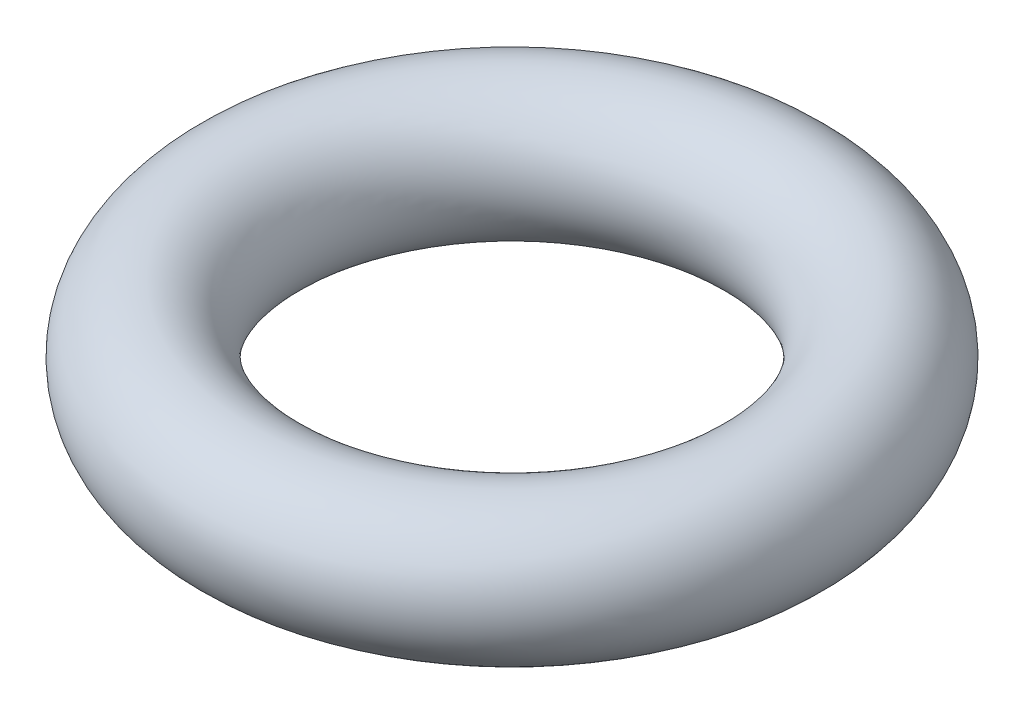
ISO-10303-21;
HEADER;
FILE_DESCRIPTION(('STEP AP214'),'2;1');
FILE_NAME('part.step','',(''),(''),'','','');
FILE_SCHEMA(('AUTOMOTIVE_DESIGN { 1 0 10303 214 1 1 1 1 }'));
ENDSEC;
DATA;
#1=APPLICATION_CONTEXT('core data for automotive mechanical design processes');
#2=APPLICATION_PROTOCOL_DEFINITION('international standard','automotive_design',2000,#1);
#3=PRODUCT_CONTEXT('',#1,'mechanical');
#4=PRODUCT('Part','Part','',(#3));
#5=PRODUCT_RELATED_PRODUCT_CATEGORY('part','',(#4));
#6=PRODUCT_DEFINITION_FORMATION('','',#4);
#7=PRODUCT_DEFINITION_CONTEXT('part definition',#1,'design');
#8=PRODUCT_DEFINITION('design','',#6,#7);
#9=PRODUCT_DEFINITION_SHAPE('','',#8);
#10=(LENGTH_UNIT() NAMED_UNIT(*) SI_UNIT(.MILLI.,.METRE.));
#11=(NAMED_UNIT(*) PLANE_ANGLE_UNIT() SI_UNIT($,.RADIAN.));
#12=(NAMED_UNIT(*) SI_UNIT($,.STERADIAN.) SOLID_ANGLE_UNIT());
#13=UNCERTAINTY_MEASURE_WITH_UNIT(LENGTH_MEASURE(1.E-05),#10,'distance_accuracy_value','');
#14=(GEOMETRIC_REPRESENTATION_CONTEXT(3) GLOBAL_UNCERTAINTY_ASSIGNED_CONTEXT((#13)) GLOBAL_UNIT_ASSIGNED_CONTEXT((#10,
#11,#12)) REPRESENTATION_CONTEXT('',''));
#15=CARTESIAN_POINT('',(0.,0.,0.));
#16=DIRECTION('',(0.,0.,1.));
#17=DIRECTION('',(1.,0.,0.));
#18=AXIS2_PLACEMENT_3D('',#15,#16,#17);
#19=CARTESIAN_POINT('',(0.,0.,0.));
#20=DIRECTION('',(0.,-1.,0.));
#21=DIRECTION('',(0.,0.,-1.));
#22=AXIS2_PLACEMENT_3D('',#19,#20,#21);
#23=TOROIDAL_SURFACE('',#22,4.75,1.25);
#24=CARTESIAN_POINT('',(0.,0.,-6.));
#25=VERTEX_POINT('',#24);
#26=VERTEX_LOOP('',#25);
#27=FACE_BOUND('',#26,.T.);
#28=ADVANCED_FACE('F28',(#27),#23,.T.);
#29=CLOSED_SHELL('',(#28));
#30=MANIFOLD_SOLID_BREP('B2',#29);
#31=ADVANCED_BREP_SHAPE_REPRESENTATION('',(#18,#30),#14);
#32=SHAPE_DEFINITION_REPRESENTATION(#9,#31);
ENDSEC;
END-ISO-10303-21;
